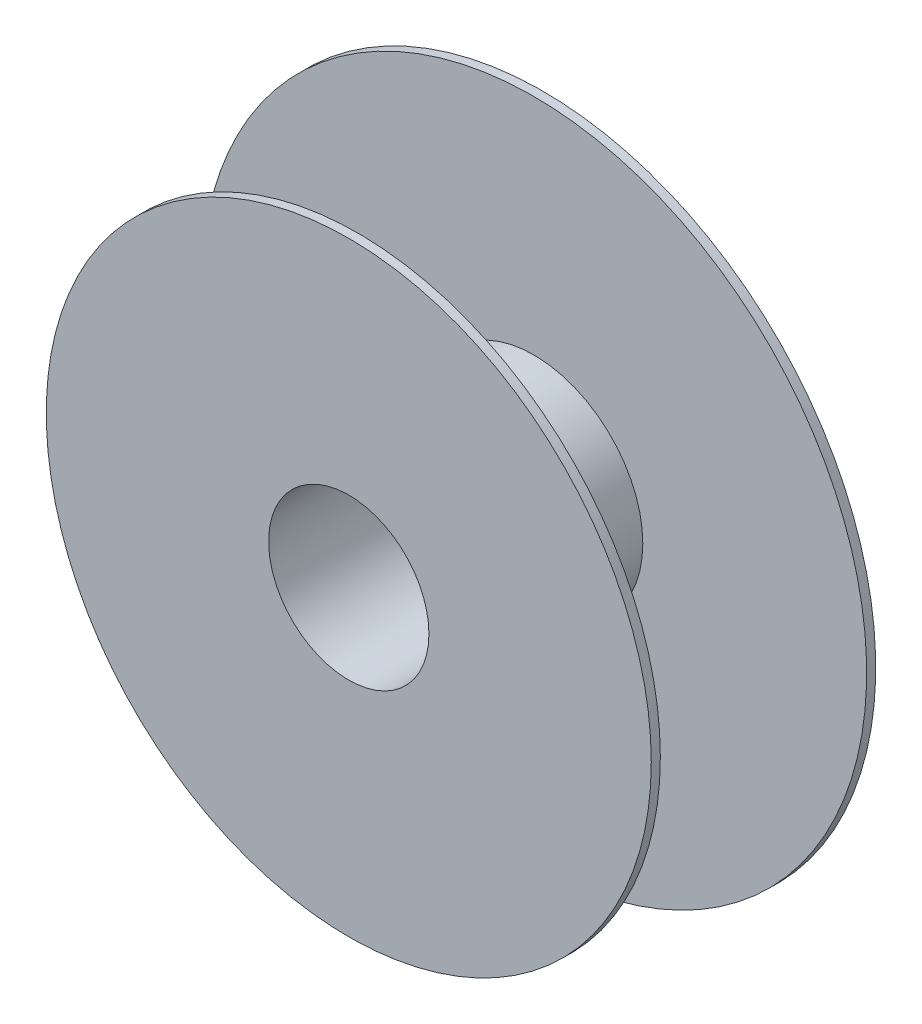
ISO-10303-21;
HEADER;
FILE_DESCRIPTION(('STEP AP214'),'2;1');
FILE_NAME('part.step','',(''),(''),'','','');
FILE_SCHEMA(('AUTOMOTIVE_DESIGN { 1 0 10303 214 1 1 1 1 }'));
ENDSEC;
DATA;
#1=APPLICATION_CONTEXT('core data for automotive mechanical design processes');
#2=APPLICATION_PROTOCOL_DEFINITION('international standard','automotive_design',2000,#1);
#3=PRODUCT_CONTEXT('',#1,'mechanical');
#4=PRODUCT('Part','Part','',(#3));
#5=PRODUCT_RELATED_PRODUCT_CATEGORY('part','',(#4));
#6=PRODUCT_DEFINITION_FORMATION('','',#4);
#7=PRODUCT_DEFINITION_CONTEXT('part definition',#1,'design');
#8=PRODUCT_DEFINITION('design','',#6,#7);
#9=PRODUCT_DEFINITION_SHAPE('','',#8);
#10=(LENGTH_UNIT() NAMED_UNIT(*) SI_UNIT(.MILLI.,.METRE.));
#11=(NAMED_UNIT(*) PLANE_ANGLE_UNIT() SI_UNIT($,.RADIAN.));
#12=(NAMED_UNIT(*) SI_UNIT($,.STERADIAN.) SOLID_ANGLE_UNIT());
#13=UNCERTAINTY_MEASURE_WITH_UNIT(LENGTH_MEASURE(1.E-05),#10,'distance_accuracy_value','');
#14=(GEOMETRIC_REPRESENTATION_CONTEXT(3) GLOBAL_UNCERTAINTY_ASSIGNED_CONTEXT((#13)) GLOBAL_UNIT_ASSIGNED_CONTEXT((#10,
#11,#12)) REPRESENTATION_CONTEXT('',''));
#15=CARTESIAN_POINT('',(0.,0.,0.));
#16=DIRECTION('',(0.,0.,1.));
#17=DIRECTION('',(1.,0.,0.));
#18=AXIS2_PLACEMENT_3D('',#15,#16,#17);
#19=CARTESIAN_POINT('',(0.,0.,-29.1));
#20=DIRECTION('',(0.,0.,1.));
#21=DIRECTION('',(1.,0.,0.));
#22=AXIS2_PLACEMENT_3D('',#19,#20,#21);
#23=CYLINDRICAL_SURFACE('',#22,36.);
#24=CARTESIAN_POINT('',(0.,0.,-29.1));
#25=DIRECTION('',(0.,0.,1.));
#26=DIRECTION('',(1.,0.,0.));
#27=AXIS2_PLACEMENT_3D('',#24,#25,#26);
#28=CIRCLE('',#27,36.);
#29=CARTESIAN_POINT('',(36.,0.,-29.1));
#30=VERTEX_POINT('',#29);
#31=EDGE_CURVE('E35',#30,#30,#28,.T.);
#32=ORIENTED_EDGE('',*,*,#31,.T.);
#33=EDGE_LOOP('',(#32));
#34=FACE_BOUND('',#33,.T.);
#35=CARTESIAN_POINT('',(0.,0.,29.1));
#36=DIRECTION('',(0.,0.,1.));
#37=DIRECTION('',(1.,0.,0.));
#38=AXIS2_PLACEMENT_3D('',#35,#36,#37);
#39=CIRCLE('',#38,36.);
#40=CARTESIAN_POINT('',(36.,0.,29.1));
#41=VERTEX_POINT('',#40);
#42=EDGE_CURVE('E10',#41,#41,#39,.T.);
#43=ORIENTED_EDGE('',*,*,#42,.F.);
#44=EDGE_LOOP('',(#43));
#45=FACE_BOUND('',#44,.T.);
#46=ADVANCED_FACE('F32',(#34,#45),#23,.T.);
#47=CARTESIAN_POINT('',(0.,0.,-29.1));
#48=DIRECTION('',(0.,0.,1.));
#49=DIRECTION('',(1.,0.,0.));
#50=AXIS2_PLACEMENT_3D('',#47,#48,#49);
#51=CYLINDRICAL_SURFACE('',#50,26.5);
#52=CARTESIAN_POINT('',(0.,0.,32.1));
#53=DIRECTION('',(0.,0.,1.));
#54=DIRECTION('',(1.,0.,0.));
#55=AXIS2_PLACEMENT_3D('',#52,#53,#54);
#56=CIRCLE('',#55,26.5);
#57=CARTESIAN_POINT('',(26.5,0.,32.1));
#58=VERTEX_POINT('',#57);
#59=EDGE_CURVE('E47',#58,#58,#56,.T.);
#60=ORIENTED_EDGE('',*,*,#59,.T.);
#61=EDGE_LOOP('',(#60));
#62=FACE_BOUND('',#61,.T.);
#63=CARTESIAN_POINT('',(0.,0.,-32.1));
#64=DIRECTION('',(0.,0.,-1.));
#65=DIRECTION('',(-1.,0.,0.));
#66=AXIS2_PLACEMENT_3D('',#63,#64,#65);
#67=CIRCLE('',#66,26.5);
#68=CARTESIAN_POINT('',(-26.5,0.,-32.1));
#69=VERTEX_POINT('',#68);
#70=EDGE_CURVE('E55',#69,#69,#67,.T.);
#71=ORIENTED_EDGE('',*,*,#70,.T.);
#72=EDGE_LOOP('',(#71));
#73=FACE_BOUND('',#72,.T.);
#74=ADVANCED_FACE('F61',(#62,#73),#51,.F.);
#75=CARTESIAN_POINT('',(0.,0.,32.1));
#76=DIRECTION('',(0.,0.,1.));
#77=DIRECTION('',(1.,0.,0.));
#78=AXIS2_PLACEMENT_3D('',#75,#76,#77);
#79=PLANE('',#78);
#80=CARTESIAN_POINT('',(0.,0.,32.1));
#81=DIRECTION('',(0.,0.,1.));
#82=DIRECTION('',(1.,0.,0.));
#83=AXIS2_PLACEMENT_3D('',#80,#81,#82);
#84=CIRCLE('',#83,100.);
#85=CARTESIAN_POINT('',(100.,0.,32.1));
#86=VERTEX_POINT('',#85);
#87=EDGE_CURVE('E39',#86,#86,#84,.T.);
#88=ORIENTED_EDGE('',*,*,#87,.T.);
#89=EDGE_LOOP('',(#88));
#90=FACE_BOUND('',#89,.T.);
#91=ORIENTED_EDGE('',*,*,#59,.F.);
#92=EDGE_LOOP('',(#91));
#93=FACE_BOUND('',#92,.T.);
#94=ADVANCED_FACE('F84',(#90,#93),#79,.T.);
#95=CARTESIAN_POINT('',(0.,0.,29.1));
#96=DIRECTION('',(0.,0.,1.));
#97=DIRECTION('',(1.,0.,0.));
#98=AXIS2_PLACEMENT_3D('',#95,#96,#97);
#99=PLANE('',#98);
#100=ORIENTED_EDGE('',*,*,#42,.T.);
#101=EDGE_LOOP('',(#100));
#102=FACE_BOUND('',#101,.T.);
#103=CARTESIAN_POINT('',(0.,0.,29.1));
#104=DIRECTION('',(0.,0.,1.));
#105=DIRECTION('',(1.,0.,0.));
#106=AXIS2_PLACEMENT_3D('',#103,#104,#105);
#107=CIRCLE('',#106,100.);
#108=CARTESIAN_POINT('',(100.,0.,29.1));
#109=VERTEX_POINT('',#108);
#110=EDGE_CURVE('E43',#109,#109,#107,.T.);
#111=ORIENTED_EDGE('',*,*,#110,.F.);
#112=EDGE_LOOP('',(#111));
#113=FACE_BOUND('',#112,.T.);
#114=ADVANCED_FACE('F76',(#102,#113),#99,.F.);
#115=CARTESIAN_POINT('',(0.,0.,32.1));
#116=DIRECTION('',(0.,0.,-1.));
#117=DIRECTION('',(-1.,0.,0.));
#118=AXIS2_PLACEMENT_3D('',#115,#116,#117);
#119=CYLINDRICAL_SURFACE('',#118,100.);
#120=ORIENTED_EDGE('',*,*,#87,.F.);
#121=EDGE_LOOP('',(#120));
#122=FACE_BOUND('',#121,.T.);
#123=ORIENTED_EDGE('',*,*,#110,.T.);
#124=EDGE_LOOP('',(#123));
#125=FACE_BOUND('',#124,.T.);
#126=ADVANCED_FACE('F66',(#122,#125),#119,.T.);
#127=CARTESIAN_POINT('',(0.,0.,-32.1));
#128=DIRECTION('',(0.,0.,-1.));
#129=DIRECTION('',(-1.,0.,0.));
#130=AXIS2_PLACEMENT_3D('',#127,#128,#129);
#131=PLANE('',#130);
#132=CARTESIAN_POINT('',(0.,0.,-32.1));
#133=DIRECTION('',(0.,0.,-1.));
#134=DIRECTION('',(-1.,0.,0.));
#135=AXIS2_PLACEMENT_3D('',#132,#133,#134);
#136=CIRCLE('',#135,110.);
#137=CARTESIAN_POINT('',(-110.,0.,-32.1));
#138=VERTEX_POINT('',#137);
#139=EDGE_CURVE('E54',#138,#138,#136,.T.);
#140=ORIENTED_EDGE('',*,*,#139,.T.);
#141=EDGE_LOOP('',(#140));
#142=FACE_BOUND('',#141,.T.);
#143=ORIENTED_EDGE('',*,*,#70,.F.);
#144=EDGE_LOOP('',(#143));
#145=FACE_BOUND('',#144,.T.);
#146=ADVANCED_FACE('F63',(#142,#145),#131,.T.);
#147=CARTESIAN_POINT('',(0.,0.,-29.1));
#148=DIRECTION('',(0.,0.,-1.));
#149=DIRECTION('',(-1.,0.,0.));
#150=AXIS2_PLACEMENT_3D('',#147,#148,#149);
#151=PLANE('',#150);
#152=ORIENTED_EDGE('',*,*,#31,.F.);
#153=EDGE_LOOP('',(#152));
#154=FACE_BOUND('',#153,.T.);
#155=CARTESIAN_POINT('',(0.,0.,-29.1));
#156=DIRECTION('',(0.,0.,-1.));
#157=DIRECTION('',(-1.,0.,0.));
#158=AXIS2_PLACEMENT_3D('',#155,#156,#157);
#159=CIRCLE('',#158,110.);
#160=CARTESIAN_POINT('',(-110.,0.,-29.1));
#161=VERTEX_POINT('',#160);
#162=EDGE_CURVE('E51',#161,#161,#159,.T.);
#163=ORIENTED_EDGE('',*,*,#162,.F.);
#164=EDGE_LOOP('',(#163));
#165=FACE_BOUND('',#164,.T.);
#166=ADVANCED_FACE('F65',(#154,#165),#151,.F.);
#167=CARTESIAN_POINT('',(0.,0.,-32.1));
#168=DIRECTION('',(0.,0.,1.));
#169=DIRECTION('',(1.,0.,0.));
#170=AXIS2_PLACEMENT_3D('',#167,#168,#169);
#171=CYLINDRICAL_SURFACE('',#170,110.);
#172=ORIENTED_EDGE('',*,*,#139,.F.);
#173=EDGE_LOOP('',(#172));
#174=FACE_BOUND('',#173,.T.);
#175=ORIENTED_EDGE('',*,*,#162,.T.);
#176=EDGE_LOOP('',(#175));
#177=FACE_BOUND('',#176,.T.);
#178=ADVANCED_FACE('F73',(#174,#177),#171,.T.);
#179=CLOSED_SHELL('',(#46,#74,#94,#114,#126,#146,#166,#178));
#180=MANIFOLD_SOLID_BREP('B2',#179);
#181=ADVANCED_BREP_SHAPE_REPRESENTATION('',(#18,#180),#14);
#182=SHAPE_DEFINITION_REPRESENTATION(#9,#181);
ENDSEC;
END-ISO-10303-21;
